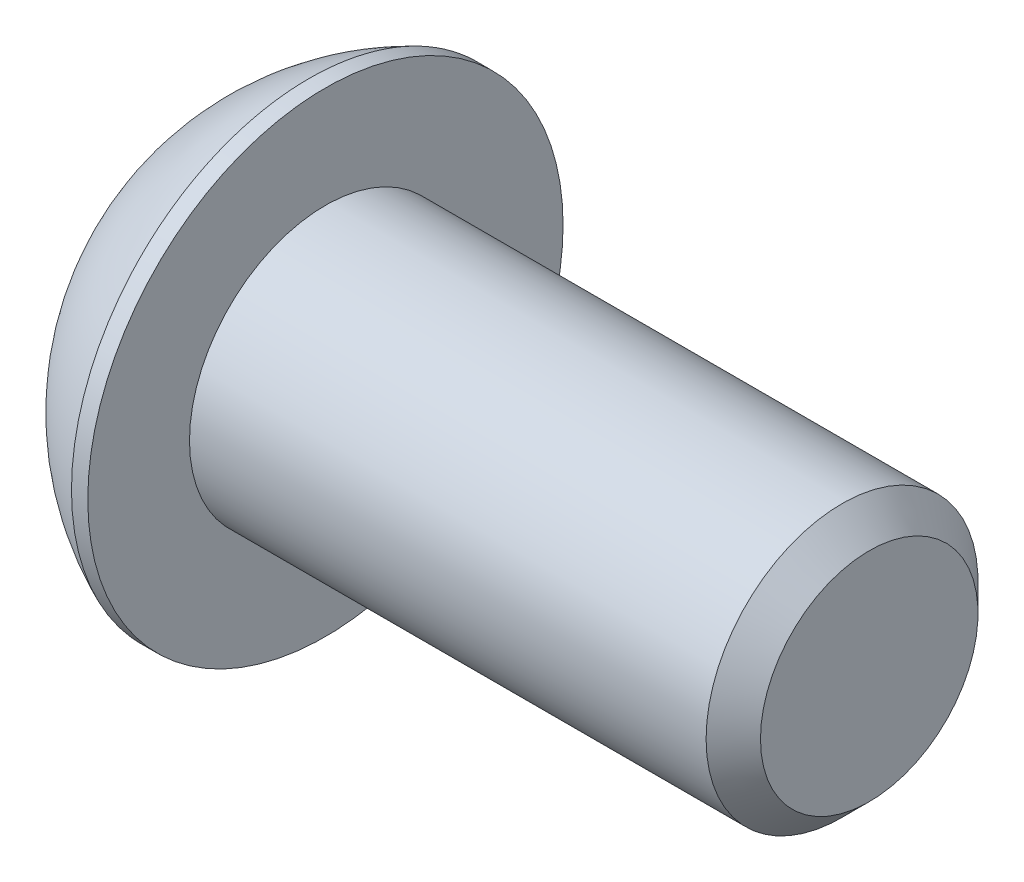
ISO-10303-21;
HEADER;
FILE_DESCRIPTION(('STEP AP214'),'2;1');
FILE_NAME('part.step','',(''),(''),'','','');
FILE_SCHEMA(('AUTOMOTIVE_DESIGN { 1 0 10303 214 1 1 1 1 }'));
ENDSEC;
DATA;
#1=APPLICATION_CONTEXT('core data for automotive mechanical design processes');
#2=APPLICATION_PROTOCOL_DEFINITION('international standard','automotive_design',2000,#1);
#3=PRODUCT_CONTEXT('',#1,'mechanical');
#4=PRODUCT('Part','Part','',(#3));
#5=PRODUCT_RELATED_PRODUCT_CATEGORY('part','',(#4));
#6=PRODUCT_DEFINITION_FORMATION('','',#4);
#7=PRODUCT_DEFINITION_CONTEXT('part definition',#1,'design');
#8=PRODUCT_DEFINITION('design','',#6,#7);
#9=PRODUCT_DEFINITION_SHAPE('','',#8);
#10=(LENGTH_UNIT() NAMED_UNIT(*) SI_UNIT(.MILLI.,.METRE.));
#11=(NAMED_UNIT(*) PLANE_ANGLE_UNIT() SI_UNIT($,.RADIAN.));
#12=(NAMED_UNIT(*) SI_UNIT($,.STERADIAN.) SOLID_ANGLE_UNIT());
#13=UNCERTAINTY_MEASURE_WITH_UNIT(LENGTH_MEASURE(1.E-05),#10,'distance_accuracy_value','');
#14=(GEOMETRIC_REPRESENTATION_CONTEXT(3) GLOBAL_UNCERTAINTY_ASSIGNED_CONTEXT((#13)) GLOBAL_UNIT_ASSIGNED_CONTEXT((#10,
#11,#12)) REPRESENTATION_CONTEXT('',''));
#15=CARTESIAN_POINT('',(0.,0.,0.));
#16=DIRECTION('',(0.,0.,1.));
#17=DIRECTION('',(1.,0.,0.));
#18=AXIS2_PLACEMENT_3D('',#15,#16,#17);
#19=CARTESIAN_POINT('',(1.32080000000034,0.,0.));
#20=DIRECTION('',(-1.,0.,0.));
#21=DIRECTION('',(0.,0.,1.));
#22=AXIS2_PLACEMENT_3D('',#19,#20,#21);
#23=CONICAL_SURFACE('',#22,1.1937999999998,1.04719755119608);
#24=CARTESIAN_POINT('',(2.01004075135902,0.,-4.44089209850063E-13));
#25=VERTEX_POINT('',#24);
#26=VERTEX_LOOP('',#25);
#27=FACE_BOUND('',#26,.T.);
#28=CARTESIAN_POINT('',(1.32080000000009,0.,0.));
#29=DIRECTION('',(-1.,0.,0.));
#30=DIRECTION('',(0.,0.,1.));
#31=AXIS2_PLACEMENT_3D('',#28,#29,#30);
#32=CIRCLE('',#31,1.19380000000024);
#33=CARTESIAN_POINT('',(1.32080000000009,0.,1.19380000000024));
#34=VERTEX_POINT('',#33);
#35=EDGE_CURVE('E19',#34,#34,#32,.T.);
#36=ORIENTED_EDGE('',*,*,#35,.T.);
#37=EDGE_LOOP('',(#36));
#38=FACE_BOUND('',#37,.T.);
#39=ADVANCED_FACE('F16',(#27,#38),#23,.F.);
#40=CARTESIAN_POINT('',(1.3208,-2.29135888084633,0.));
#41=DIRECTION('',(1.,0.,0.));
#42=DIRECTION('',(0.,0.,-1.));
#43=AXIS2_PLACEMENT_3D('',#40,#41,#42);
#44=PLANE('',#43);
#45=DIRECTION('',(0.,1.,0.));
#46=VECTOR('',#45,1.);
#47=CARTESIAN_POINT('',(1.3208,-1.14567944042316,1.984375));
#48=LINE('',#47,#46);
#49=CARTESIAN_POINT('',(1.3208,1.14567944042316,1.984375));
#50=VERTEX_POINT('',#49);
#51=CARTESIAN_POINT('',(1.3208,-1.14567944042316,1.984375));
#52=VERTEX_POINT('',#51);
#53=EDGE_CURVE('E68',#50,#52,#48,.F.);
#54=ORIENTED_EDGE('',*,*,#53,.F.);
#55=DIRECTION('',(0.,0.5,-0.866025403784439));
#56=VECTOR('',#55,1.);
#57=CARTESIAN_POINT('',(1.3208,1.14567944042316,1.984375));
#58=LINE('',#57,#56);
#59=CARTESIAN_POINT('',(1.3208,2.29135888084633,0.));
#60=VERTEX_POINT('',#59);
#61=EDGE_CURVE('E291',#60,#50,#58,.F.);
#62=ORIENTED_EDGE('',*,*,#61,.F.);
#63=DIRECTION('',(0.,-0.5,-0.866025403784439));
#64=VECTOR('',#63,1.);
#65=CARTESIAN_POINT('',(1.3208,2.29135888084633,0.));
#66=LINE('',#65,#64);
#67=CARTESIAN_POINT('',(1.3208,1.14567944042316,-1.984375));
#68=VERTEX_POINT('',#67);
#69=EDGE_CURVE('E295',#68,#60,#66,.F.);
#70=ORIENTED_EDGE('',*,*,#69,.F.);
#71=DIRECTION('',(0.,1.,0.));
#72=VECTOR('',#71,1.);
#73=CARTESIAN_POINT('',(1.3208,1.14567944042316,-1.984375));
#74=LINE('',#73,#72);
#75=CARTESIAN_POINT('',(1.3208,-1.14567944042316,-1.984375));
#76=VERTEX_POINT('',#75);
#77=EDGE_CURVE('E300',#76,#68,#74,.T.);
#78=ORIENTED_EDGE('',*,*,#77,.F.);
#79=DIRECTION('',(0.,-0.500000000000001,0.866025403784438));
#80=VECTOR('',#79,1.);
#81=CARTESIAN_POINT('',(1.3208,-1.14567944042316,-1.984375));
#82=LINE('',#81,#80);
#83=CARTESIAN_POINT('',(1.3208,-2.29135888084633,0.));
#84=VERTEX_POINT('',#83);
#85=EDGE_CURVE('E305',#84,#76,#82,.F.);
#86=ORIENTED_EDGE('',*,*,#85,.F.);
#87=DIRECTION('',(0.,0.500000000000001,0.866025403784438));
#88=VECTOR('',#87,1.);
#89=CARTESIAN_POINT('',(1.3208,-2.29135888084633,0.));
#90=LINE('',#89,#88);
#91=EDGE_CURVE('E81',#52,#84,#90,.F.);
#92=ORIENTED_EDGE('',*,*,#91,.F.);
#93=EDGE_LOOP('',(#54,#62,#70,#78,#86,#92));
#94=FACE_BOUND('',#93,.T.);
#95=ORIENTED_EDGE('',*,*,#35,.F.);
#96=EDGE_LOOP('',(#95));
#97=FACE_BOUND('',#96,.T.);
#98=ADVANCED_FACE('F74',(#94,#97),#44,.F.);
#99=CARTESIAN_POINT('',(1.3208,-1.14567944042316,1.984375));
#100=DIRECTION('',(0.,0.,-1.));
#101=DIRECTION('',(0.,1.,0.));
#102=AXIS2_PLACEMENT_3D('',#99,#100,#101);
#103=PLANE('',#102);
#104=ORIENTED_EDGE('',*,*,#53,.T.);
#105=DIRECTION('',(1.,0.,0.));
#106=VECTOR('',#105,1.);
#107=CARTESIAN_POINT('',(1.3208,-1.14567944042316,1.984375));
#108=LINE('',#107,#106);
#109=CARTESIAN_POINT('',(0.,-1.14567944042316,1.984375));
#110=VERTEX_POINT('',#109);
#111=EDGE_CURVE('E78',#110,#52,#108,.T.);
#112=ORIENTED_EDGE('',*,*,#111,.F.);
#113=DIRECTION('',(0.,1.,0.));
#114=VECTOR('',#113,1.);
#115=CARTESIAN_POINT('',(0.,0.,1.984375));
#116=LINE('',#115,#114);
#117=CARTESIAN_POINT('',(0.,1.14567944042316,1.984375));
#118=VERTEX_POINT('',#117);
#119=EDGE_CURVE('E285',#118,#110,#116,.F.);
#120=ORIENTED_EDGE('',*,*,#119,.F.);
#121=DIRECTION('',(1.,0.,0.));
#122=VECTOR('',#121,1.);
#123=CARTESIAN_POINT('',(1.3208,1.14567944042316,1.984375));
#124=LINE('',#123,#122);
#125=EDGE_CURVE('E288',#50,#118,#124,.F.);
#126=ORIENTED_EDGE('',*,*,#125,.F.);
#127=EDGE_LOOP('',(#104,#112,#120,#126));
#128=FACE_BOUND('',#127,.T.);
#129=ADVANCED_FACE('F127',(#128),#103,.T.);
#130=CARTESIAN_POINT('',(1.3208,-2.29135888084633,0.));
#131=DIRECTION('',(0.,0.866025403784438,-0.500000000000001));
#132=DIRECTION('',(0.,0.500000000000001,0.866025403784438));
#133=AXIS2_PLACEMENT_3D('',#130,#131,#132);
#134=PLANE('',#133);
#135=ORIENTED_EDGE('',*,*,#91,.T.);
#136=DIRECTION('',(1.,0.,0.));
#137=VECTOR('',#136,1.);
#138=CARTESIAN_POINT('',(1.3208,-2.29135888084633,0.));
#139=LINE('',#138,#137);
#140=CARTESIAN_POINT('',(0.,-2.29135888084633,0.));
#141=VERTEX_POINT('',#140);
#142=EDGE_CURVE('E307',#141,#84,#139,.T.);
#143=ORIENTED_EDGE('',*,*,#142,.F.);
#144=DIRECTION('',(0.,-0.500000000000001,-0.866025403784438));
#145=VECTOR('',#144,1.);
#146=CARTESIAN_POINT('',(0.,-1.14567944042316,1.984375));
#147=LINE('',#146,#145);
#148=EDGE_CURVE('E282',#110,#141,#147,.T.);
#149=ORIENTED_EDGE('',*,*,#148,.F.);
#150=ORIENTED_EDGE('',*,*,#111,.T.);
#151=EDGE_LOOP('',(#135,#143,#149,#150));
#152=FACE_BOUND('',#151,.T.);
#153=ADVANCED_FACE('F123',(#152),#134,.T.);
#154=CARTESIAN_POINT('',(1.3208,-1.14567944042316,-1.984375));
#155=DIRECTION('',(0.,0.866025403784438,0.500000000000001));
#156=DIRECTION('',(0.,-0.500000000000001,0.866025403784438));
#157=AXIS2_PLACEMENT_3D('',#154,#155,#156);
#158=PLANE('',#157);
#159=ORIENTED_EDGE('',*,*,#85,.T.);
#160=DIRECTION('',(1.,0.,0.));
#161=VECTOR('',#160,1.);
#162=CARTESIAN_POINT('',(1.3208,-1.14567944042316,-1.984375));
#163=LINE('',#162,#161);
#164=CARTESIAN_POINT('',(0.,-1.14567944042316,-1.984375));
#165=VERTEX_POINT('',#164);
#166=EDGE_CURVE('E302',#165,#76,#163,.T.);
#167=ORIENTED_EDGE('',*,*,#166,.F.);
#168=DIRECTION('',(0.,0.500000000000001,-0.866025403784438));
#169=VECTOR('',#168,1.);
#170=CARTESIAN_POINT('',(0.,-2.29135888084633,0.));
#171=LINE('',#170,#169);
#172=EDGE_CURVE('E279',#141,#165,#171,.T.);
#173=ORIENTED_EDGE('',*,*,#172,.F.);
#174=ORIENTED_EDGE('',*,*,#142,.T.);
#175=EDGE_LOOP('',(#159,#167,#173,#174));
#176=FACE_BOUND('',#175,.T.);
#177=ADVANCED_FACE('F119',(#176),#158,.T.);
#178=CARTESIAN_POINT('',(1.3208,1.14567944042316,-1.984375));
#179=DIRECTION('',(0.,0.,1.));
#180=DIRECTION('',(1.,0.,0.));
#181=AXIS2_PLACEMENT_3D('',#178,#179,#180);
#182=PLANE('',#181);
#183=ORIENTED_EDGE('',*,*,#77,.T.);
#184=DIRECTION('',(1.,0.,0.));
#185=VECTOR('',#184,1.);
#186=CARTESIAN_POINT('',(1.3208,1.14567944042316,-1.984375));
#187=LINE('',#186,#185);
#188=CARTESIAN_POINT('',(0.,1.14567944042316,-1.984375));
#189=VERTEX_POINT('',#188);
#190=EDGE_CURVE('E297',#189,#68,#187,.T.);
#191=ORIENTED_EDGE('',*,*,#190,.F.);
#192=DIRECTION('',(0.,1.,0.));
#193=VECTOR('',#192,1.);
#194=CARTESIAN_POINT('',(0.,0.,-1.984375));
#195=LINE('',#194,#193);
#196=EDGE_CURVE('E276',#165,#189,#195,.T.);
#197=ORIENTED_EDGE('',*,*,#196,.F.);
#198=ORIENTED_EDGE('',*,*,#166,.T.);
#199=EDGE_LOOP('',(#183,#191,#197,#198));
#200=FACE_BOUND('',#199,.T.);
#201=ADVANCED_FACE('F116',(#200),#182,.T.);
#202=CARTESIAN_POINT('',(1.3208,2.29135888084633,0.));
#203=DIRECTION('',(0.,-0.866025403784439,0.5));
#204=DIRECTION('',(0.,-0.5,-0.866025403784439));
#205=AXIS2_PLACEMENT_3D('',#202,#203,#204);
#206=PLANE('',#205);
#207=ORIENTED_EDGE('',*,*,#69,.T.);
#208=DIRECTION('',(1.,0.,0.));
#209=VECTOR('',#208,1.);
#210=CARTESIAN_POINT('',(1.3208,2.29135888084633,0.));
#211=LINE('',#210,#209);
#212=CARTESIAN_POINT('',(0.,2.29135888084633,0.));
#213=VERTEX_POINT('',#212);
#214=EDGE_CURVE('E34',#213,#60,#211,.T.);
#215=ORIENTED_EDGE('',*,*,#214,.F.);
#216=DIRECTION('',(0.,0.5,0.866025403784439));
#217=VECTOR('',#216,1.);
#218=CARTESIAN_POINT('',(0.,1.14567944042316,-1.984375));
#219=LINE('',#218,#217);
#220=EDGE_CURVE('E273',#189,#213,#219,.T.);
#221=ORIENTED_EDGE('',*,*,#220,.F.);
#222=ORIENTED_EDGE('',*,*,#190,.T.);
#223=EDGE_LOOP('',(#207,#215,#221,#222));
#224=FACE_BOUND('',#223,.T.);
#225=ADVANCED_FACE('F112',(#224),#206,.T.);
#226=CARTESIAN_POINT('',(1.3208,1.14567944042316,1.984375));
#227=DIRECTION('',(0.,-0.866025403784439,-0.5));
#228=DIRECTION('',(0.,0.5,-0.866025403784439));
#229=AXIS2_PLACEMENT_3D('',#226,#227,#228);
#230=PLANE('',#229);
#231=ORIENTED_EDGE('',*,*,#61,.T.);
#232=ORIENTED_EDGE('',*,*,#125,.T.);
#233=DIRECTION('',(0.,-0.5,0.866025403784438));
#234=VECTOR('',#233,1.);
#235=CARTESIAN_POINT('',(0.,2.29135888084633,0.));
#236=LINE('',#235,#234);
#237=EDGE_CURVE('E99',#213,#118,#236,.T.);
#238=ORIENTED_EDGE('',*,*,#237,.F.);
#239=ORIENTED_EDGE('',*,*,#214,.T.);
#240=EDGE_LOOP('',(#231,#232,#238,#239));
#241=FACE_BOUND('',#240,.T.);
#242=ADVANCED_FACE('F108',(#241),#230,.T.);
#243=CARTESIAN_POINT('',(0.,0.,0.));
#244=DIRECTION('',(-1.,0.,0.));
#245=DIRECTION('',(0.,0.,1.));
#246=AXIS2_PLACEMENT_3D('',#243,#244,#245);
#247=PLANE('',#246);
#248=ORIENTED_EDGE('',*,*,#220,.T.);
#249=ORIENTED_EDGE('',*,*,#237,.T.);
#250=ORIENTED_EDGE('',*,*,#119,.T.);
#251=ORIENTED_EDGE('',*,*,#148,.T.);
#252=ORIENTED_EDGE('',*,*,#172,.T.);
#253=ORIENTED_EDGE('',*,*,#196,.T.);
#254=EDGE_LOOP('',(#248,#249,#250,#251,#252,#253));
#255=FACE_BOUND('',#254,.T.);
#256=CARTESIAN_POINT('',(0.,2.77495,0.));
#257=CARTESIAN_POINT('',(0.,2.77494953309947,0.0779118937523459));
#258=CARTESIAN_POINT('',(0.,2.77166578388025,0.15583810591977));
#259=CARTESIAN_POINT('',(0.,2.75855213600204,0.311152012455904));
#260=CARTESIAN_POINT('',(0.,2.74872030471467,0.388539541019556));
#261=CARTESIAN_POINT('',(0.,2.72255472645676,0.542341518735717));
#262=CARTESIAN_POINT('',(-2.70414110576258E-13,2.70621065843663,0.618754223567578));
#263=CARTESIAN_POINT('',(2.71501725221868E-13,2.66713326915777,0.769973634286023));
#264=CARTESIAN_POINT('',(1.01274952524446E-12,2.64439476297869,0.844778983646282));
#265=CARTESIAN_POINT('',(1.81909959813207E-12,2.56690195943351,1.06566239301792));
#266=CARTESIAN_POINT('',(4.77081687541822E-13,2.50280672569928,1.20857954243987));
#267=CARTESIAN_POINT('',(-4.76232447128612E-13,2.35149826934097,1.48160874561538));
#268=CARTESIAN_POINT('',(0.,2.26428416790397,1.61172031233499));
#269=CARTESIAN_POINT('',(0.,2.1181093928834,1.79445660654268));
#270=CARTESIAN_POINT('',(0.,2.06678693791626,1.85333128513996));
#271=CARTESIAN_POINT('',(0.,1.95940522984449,1.96650727912792));
#272=CARTESIAN_POINT('',(0.,1.90335059143535,2.02081294920044));
#273=CARTESIAN_POINT('',(0.,1.78683891013963,2.12453280878582));
#274=CARTESIAN_POINT('',(0.,1.72637988450322,2.1739447713554));
#275=CARTESIAN_POINT('',(0.,1.60151968865711,2.26750481692908));
#276=CARTESIAN_POINT('',(0.,1.53711760864537,2.31165167810847));
#277=CARTESIAN_POINT('',(0.,1.33869902291632,2.43567242603944));
#278=CARTESIAN_POINT('',(0.,1.19934704110695,2.507235886628));
#279=CARTESIAN_POINT('',(0.,0.910681609121881,2.62590828672821));
#280=CARTESIAN_POINT('',(0.,0.761368265357398,2.67301748742278));
#281=CARTESIAN_POINT('',(0.,0.456932649466623,2.74151230664007));
#282=CARTESIAN_POINT('',(0.,0.301810346322584,2.76289778778721));
#283=CARTESIAN_POINT('',(0.,-0.00982263870895171,2.77931595661156));
#284=CARTESIAN_POINT('',(0.,-0.166333320596448,2.77434864428877));
#285=CARTESIAN_POINT('',(0.,-0.476280836814452,2.73822217653073));
#286=CARTESIAN_POINT('',(0.,-0.629717687555985,2.70706316096981));
#287=CARTESIAN_POINT('',(0.,-0.929254830044274,2.61937980771149));
#288=CARTESIAN_POINT('',(0.,-1.0753550434132,2.56285519909568));
#289=CARTESIAN_POINT('',(0.,-1.28570692598579,2.46037024128109));
#290=CARTESIAN_POINT('',(0.,-1.35439130022287,2.42323494812896));
#291=CARTESIAN_POINT('',(0.,-1.488391287199,2.34331277270256));
#292=CARTESIAN_POINT('',(0.,-1.55370767631787,2.30052720108831));
#293=CARTESIAN_POINT('',(0.,-1.68047292776594,2.20962421887055));
#294=CARTESIAN_POINT('',(0.,-1.7419235278682,2.16150923122348));
#295=CARTESIAN_POINT('',(0.,-1.86060297067992,2.06024311301283));
#296=CARTESIAN_POINT('',(0.,-1.91782768181715,2.0070871669763));
#297=CARTESIAN_POINT('',(0.,-2.08239462196651,1.8407220856554));
#298=CARTESIAN_POINT('',(0.,-2.18279764272601,1.72049499758422));
#299=CARTESIAN_POINT('',(0.,-2.36195754944063,1.46487629213018));
#300=CARTESIAN_POINT('',(0.,-2.44071525816758,1.32948525142807));
#301=CARTESIAN_POINT('',(0.,-2.54098882695274,1.11796734074395));
#302=CARTESIAN_POINT('',(0.,-2.57146177392727,1.04596540008347));
#303=CARTESIAN_POINT('',(0.,-2.62621251108999,0.899689259475764));
#304=CARTESIAN_POINT('',(0.,-2.65049531495563,0.825416953360952));
#305=CARTESIAN_POINT('',(0.,-2.69267708798766,0.675215808695207));
#306=CARTESIAN_POINT('',(0.,-2.71058613777937,0.599289789313092));
#307=CARTESIAN_POINT('',(0.,-2.73994710360127,0.446213628496932));
#308=CARTESIAN_POINT('',(0.,-2.75140092413871,0.369063855024788));
#309=CARTESIAN_POINT('',(0.,-2.76470470685522,0.24316208817343));
#310=CARTESIAN_POINT('',(0.,-2.76854547596618,0.194611672428577));
#311=CARTESIAN_POINT('',(0.,-2.77366826843264,0.0973760351839812));
#312=CARTESIAN_POINT('',(0.,-2.77495029178814,0.0486908136842395));
#313=CARTESIAN_POINT('',(0.,-2.77494953309947,-0.0779118937523475));
#314=CARTESIAN_POINT('',(0.,-2.77166578388025,-0.155838105919772));
#315=CARTESIAN_POINT('',(0.,-2.75855213600204,-0.311152012455906));
#316=CARTESIAN_POINT('',(0.,-2.74872030471467,-0.388539541019558));
#317=CARTESIAN_POINT('',(0.,-2.72255472645677,-0.542341518735719));
#318=CARTESIAN_POINT('',(-2.70149297926331E-13,-2.70621065843663,-0.61875422356758));
#319=CARTESIAN_POINT('',(2.712366972268E-13,-2.66713326915777,-0.769973634286024));
#320=CARTESIAN_POINT('',(1.0114146773846E-12,-2.64439476297869,-0.844778983646283));
#321=CARTESIAN_POINT('',(1.81656702958366E-12,-2.5669019594335,-1.06566239301792));
#322=CARTESIAN_POINT('',(4.7641829195856E-13,-2.50280672569928,-1.20857954243988));
#323=CARTESIAN_POINT('',(-4.75569026324205E-13,-2.35149826934097,-1.48160874561538));
#324=CARTESIAN_POINT('',(0.,-2.26428416790396,-1.61172031233499));
#325=CARTESIAN_POINT('',(0.,-2.1181093928834,-1.79445660654268));
#326=CARTESIAN_POINT('',(0.,-2.06678693791626,-1.85333128513997));
#327=CARTESIAN_POINT('',(0.,-1.95940522984449,-1.96650727912792));
#328=CARTESIAN_POINT('',(0.,-1.90335059143535,-2.02081294920044));
#329=CARTESIAN_POINT('',(0.,-1.78683891013963,-2.12453280878582));
#330=CARTESIAN_POINT('',(0.,-1.72637988450322,-2.1739447713554));
#331=CARTESIAN_POINT('',(0.,-1.60151968865711,-2.26750481692908));
#332=CARTESIAN_POINT('',(0.,-1.53711760864537,-2.31165167810847));
#333=CARTESIAN_POINT('',(0.,-1.33869902291632,-2.43567242603944));
#334=CARTESIAN_POINT('',(0.,-1.19934704110695,-2.507235886628));
#335=CARTESIAN_POINT('',(0.,-0.91068160912188,-2.62590828672821));
#336=CARTESIAN_POINT('',(0.,-0.761368265357396,-2.67301748742278));
#337=CARTESIAN_POINT('',(0.,-0.456932649466621,-2.74151230664007));
#338=CARTESIAN_POINT('',(0.,-0.301810346322582,-2.76289778778721));
#339=CARTESIAN_POINT('',(0.,0.00982263870895353,-2.77931595661156));
#340=CARTESIAN_POINT('',(0.,0.16633332059645,-2.77434864428876));
#341=CARTESIAN_POINT('',(0.,0.476280836814454,-2.73822217653073));
#342=CARTESIAN_POINT('',(0.,0.629717687555987,-2.70706316096981));
#343=CARTESIAN_POINT('',(0.,0.929254830044276,-2.6193798077115));
#344=CARTESIAN_POINT('',(0.,1.0753550434132,-2.56285519909568));
#345=CARTESIAN_POINT('',(0.,1.28570692598579,-2.46037024128109));
#346=CARTESIAN_POINT('',(0.,1.35439130022287,-2.42323494812896));
#347=CARTESIAN_POINT('',(0.,1.488391287199,-2.34331277270256));
#348=CARTESIAN_POINT('',(0.,1.55370767631787,-2.30052720108831));
#349=CARTESIAN_POINT('',(0.,1.68047292776594,-2.20962421887055));
#350=CARTESIAN_POINT('',(0.,1.7419235278682,-2.16150923122348));
#351=CARTESIAN_POINT('',(0.,1.86060297067992,-2.06024311301282));
#352=CARTESIAN_POINT('',(0.,1.91782768181716,-2.0070871669763));
#353=CARTESIAN_POINT('',(0.,2.08239462196651,-1.8407220856554));
#354=CARTESIAN_POINT('',(0.,2.18279764272601,-1.72049499758422));
#355=CARTESIAN_POINT('',(0.,2.36195754944063,-1.46487629213018));
#356=CARTESIAN_POINT('',(0.,2.44071525816757,-1.32948525142807));
#357=CARTESIAN_POINT('',(0.,2.54098882695273,-1.11796734074395));
#358=CARTESIAN_POINT('',(0.,2.57146177392727,-1.04596540008347));
#359=CARTESIAN_POINT('',(0.,2.62621251108999,-0.899689259475765));
#360=CARTESIAN_POINT('',(0.,2.65049531495563,-0.825416953360953));
#361=CARTESIAN_POINT('',(0.,2.69267708798766,-0.675215808695207));
#362=CARTESIAN_POINT('',(0.,2.71058613777936,-0.599289789313092));
#363=CARTESIAN_POINT('',(0.,2.73994710360127,-0.446213628496932));
#364=CARTESIAN_POINT('',(0.,2.75140092413871,-0.369063855024789));
#365=CARTESIAN_POINT('',(0.,2.76470470685522,-0.243162088173432));
#366=CARTESIAN_POINT('',(0.,2.76854547596618,-0.194611672428578));
#367=CARTESIAN_POINT('',(0.,2.77366826843264,-0.0973760351839823));
#368=CARTESIAN_POINT('',(0.,2.77495029178814,-0.0486908136842408));
#369=CARTESIAN_POINT('',(0.,2.77495,0.));
#370=B_SPLINE_CURVE_WITH_KNOTS('',3,(#256,#257,#258,#259,#260,#261,#262,#263,#264,#265,#266,
#267,#268,#269,#270,#271,#272,#273,#274,#275,#276,#277,#278,#279,#280,#281,#282,#283,#284,#285,
#286,#287,#288,#289,#290,#291,#292,#293,#294,#295,#296,#297,#298,#299,#300,#301,#302,#303,#304,
#305,#306,#307,#308,#309,#310,#311,#312,#313,#314,#315,#316,#317,#318,#319,#320,#321,#322,#323,
#324,#325,#326,#327,#328,#329,#330,#331,#332,#333,#334,#335,#336,#337,#338,#339,#340,#341,#342,
#343,#344,#345,#346,#347,#348,#349,#350,#351,#352,#353,#354,#355,#356,#357,#358,#359,#360,#361,
#362,#363,#364,#365,#366,#367,#368,#369),.UNSPECIFIED.,.T.,.F.,(4,2,2,2,2,2,2,2,2,2,2,2,2,2,2,2,
2,2,2,2,2,2,2,2,2,2,2,2,2,2,2,2,2,2,2,2,2,2,2,2,2,2,2,2,2,2,2,2,2,2,2,2,2,2,2,2,4),(0.,
0.233690856748162,0.467450716578751,0.701582538521471,0.935904756015414,1.40343220467667,
1.87097742791502,2.10505636898837,2.33890962270652,2.57286880998746,2.80688218486306,
3.27442101763127,3.74195485676357,4.20949119271389,4.67702752866417,5.14456136779641,
5.61210020056468,5.84611357544033,6.08007276272136,6.31392601643949,6.54800495751273,
7.01555018075072,7.48307762941212,7.71739984690652,7.95153166884955,8.18529152868023,
8.41898238542855,8.56502681353347,8.71107124163843,8.94476209838659,9.17852195821718,
9.4126537801599,9.64697599765384,10.1145034463151,10.5820486695534,10.8161276106268,
11.0499808643449,11.2839400516259,11.5179534265015,11.9854922592697,12.453026098402,
12.9205624343523,13.3880987703026,13.8556326094348,14.3231714422031,14.5571848170788,
14.7911440043598,15.0249972580779,15.2590761991512,15.7266214223891,16.1941488710506,
16.4284710885449,16.662602910488,16.8963627703186,17.130053627067,17.2760980551719,
17.4221424832769),.UNSPECIFIED.);
#371=CARTESIAN_POINT('',(0.,2.77495,0.));
#372=VERTEX_POINT('',#371);
#373=EDGE_CURVE('E93',#372,#372,#370,.T.);
#374=ORIENTED_EDGE('',*,*,#373,.F.);
#375=EDGE_LOOP('',(#374));
#376=FACE_BOUND('',#375,.T.);
#377=ADVANCED_FACE('F104',(#255,#376),#247,.T.);
#378=CARTESIAN_POINT('',(5.37260881410256,0.,0.));
#379=DIRECTION('',(0.,1.,0.));
#380=DIRECTION('',(1.,0.,0.));
#381=AXIS2_PLACEMENT_3D('',#378,#379,#380);
#382=SPHERICAL_SURFACE('',#381,6.04692260342999);
#383=CARTESIAN_POINT('',(2.9718,0.,0.));
#384=DIRECTION('',(-1.,0.,0.));
#385=DIRECTION('',(0.,0.,1.));
#386=AXIS2_PLACEMENT_3D('',#383,#384,#385);
#387=CIRCLE('',#386,5.5499);
#388=CARTESIAN_POINT('',(2.9718,0.,5.5499));
#389=VERTEX_POINT('',#388);
#390=EDGE_CURVE('E91',#389,#389,#387,.F.);
#391=ORIENTED_EDGE('',*,*,#390,.F.);
#392=EDGE_LOOP('',(#391));
#393=FACE_BOUND('',#392,.T.);
#394=ORIENTED_EDGE('',*,*,#373,.T.);
#395=EDGE_LOOP('',(#394));
#396=FACE_BOUND('',#395,.T.);
#397=ADVANCED_FACE('F100',(#393,#396),#382,.T.);
#398=CARTESIAN_POINT('',(16.0528,0.,0.));
#399=DIRECTION('',(-1.,0.,0.));
#400=DIRECTION('',(0.,0.,1.));
#401=AXIS2_PLACEMENT_3D('',#398,#399,#400);
#402=PLANE('',#401);
#403=CARTESIAN_POINT('',(16.0528000000681,0.,0.));
#404=DIRECTION('',(-1.,0.,0.));
#405=DIRECTION('',(0.,0.,1.));
#406=AXIS2_PLACEMENT_3D('',#403,#404,#405);
#407=CIRCLE('',#406,2.54000000001042);
#408=CARTESIAN_POINT('',(16.0528000000681,0.,2.54000000001042));
#409=VERTEX_POINT('',#408);
#410=EDGE_CURVE('E88',#409,#409,#407,.T.);
#411=ORIENTED_EDGE('',*,*,#410,.F.);
#412=EDGE_LOOP('',(#411));
#413=FACE_BOUND('',#412,.T.);
#414=ADVANCED_FACE('F153',(#413),#402,.F.);
#415=CARTESIAN_POINT('',(0.,0.,0.));
#416=DIRECTION('',(-1.,0.,0.));
#417=DIRECTION('',(0.,0.,1.));
#418=AXIS2_PLACEMENT_3D('',#415,#416,#417);
#419=CYLINDRICAL_SURFACE('',#418,5.5499);
#420=ORIENTED_EDGE('',*,*,#390,.T.);
#421=EDGE_LOOP('',(#420));
#422=FACE_BOUND('',#421,.T.);
#423=CARTESIAN_POINT('',(3.3528,0.,0.));
#424=DIRECTION('',(-1.,0.,0.));
#425=DIRECTION('',(0.,0.,1.));
#426=AXIS2_PLACEMENT_3D('',#423,#424,#425);
#427=CIRCLE('',#426,5.5499);
#428=CARTESIAN_POINT('',(3.3528,0.,5.5499));
#429=VERTEX_POINT('',#428);
#430=EDGE_CURVE('E85',#429,#429,#427,.T.);
#431=ORIENTED_EDGE('',*,*,#430,.T.);
#432=EDGE_LOOP('',(#431));
#433=FACE_BOUND('',#432,.T.);
#434=ADVANCED_FACE('F150',(#422,#433),#419,.T.);
#435=CARTESIAN_POINT('',(15.4178000000229,0.,0.));
#436=DIRECTION('',(-1.,0.,0.));
#437=DIRECTION('',(0.,0.,1.));
#438=AXIS2_PLACEMENT_3D('',#435,#436,#437);
#439=CONICAL_SURFACE('',#438,3.17500000005566,0.785398163397448);
#440=CARTESIAN_POINT('',(15.4178,0.,0.));
#441=DIRECTION('',(-1.,0.,0.));
#442=DIRECTION('',(0.,0.,1.));
#443=AXIS2_PLACEMENT_3D('',#440,#441,#442);
#444=CIRCLE('',#443,3.175);
#445=CARTESIAN_POINT('',(15.4178,0.,3.175));
#446=VERTEX_POINT('',#445);
#447=EDGE_CURVE('E25',#446,#446,#444,.T.);
#448=ORIENTED_EDGE('',*,*,#447,.F.);
#449=EDGE_LOOP('',(#448));
#450=FACE_BOUND('',#449,.T.);
#451=ORIENTED_EDGE('',*,*,#410,.T.);
#452=EDGE_LOOP('',(#451));
#453=FACE_BOUND('',#452,.T.);
#454=ADVANCED_FACE('F143',(#450,#453),#439,.T.);
#455=CARTESIAN_POINT('',(3.3528,3.175,0.));
#456=DIRECTION('',(-1.,0.,0.));
#457=DIRECTION('',(0.,0.,1.));
#458=AXIS2_PLACEMENT_3D('',#455,#456,#457);
#459=PLANE('',#458);
#460=CARTESIAN_POINT('',(3.3528,0.,0.));
#461=DIRECTION('',(-1.,0.,0.));
#462=DIRECTION('',(0.,0.,1.));
#463=AXIS2_PLACEMENT_3D('',#460,#461,#462);
#464=CIRCLE('',#463,3.175);
#465=CARTESIAN_POINT('',(3.3528,0.,3.175));
#466=VERTEX_POINT('',#465);
#467=EDGE_CURVE('E11',#466,#466,#464,.F.);
#468=ORIENTED_EDGE('',*,*,#467,.F.);
#469=EDGE_LOOP('',(#468));
#470=FACE_BOUND('',#469,.T.);
#471=ORIENTED_EDGE('',*,*,#430,.F.);
#472=EDGE_LOOP('',(#471));
#473=FACE_BOUND('',#472,.T.);
#474=ADVANCED_FACE('F137',(#470,#473),#459,.F.);
#475=CARTESIAN_POINT('',(0.,0.,0.));
#476=DIRECTION('',(-1.,0.,0.));
#477=DIRECTION('',(0.,0.,1.));
#478=AXIS2_PLACEMENT_3D('',#475,#476,#477);
#479=CYLINDRICAL_SURFACE('',#478,3.175);
#480=ORIENTED_EDGE('',*,*,#467,.T.);
#481=EDGE_LOOP('',(#480));
#482=FACE_BOUND('',#481,.T.);
#483=ORIENTED_EDGE('',*,*,#447,.T.);
#484=EDGE_LOOP('',(#483));
#485=FACE_BOUND('',#484,.T.);
#486=ADVANCED_FACE('F135',(#482,#485),#479,.T.);
#487=CLOSED_SHELL('',(#39,#98,#129,#153,#177,#201,#225,#242,#377,#397,#414,#434,#454,#474,#486));
#488=MANIFOLD_SOLID_BREP('B1',#487);
#489=ADVANCED_BREP_SHAPE_REPRESENTATION('',(#18,#488),#14);
#490=SHAPE_DEFINITION_REPRESENTATION(#9,#489);
ENDSEC;
END-ISO-10303-21;
